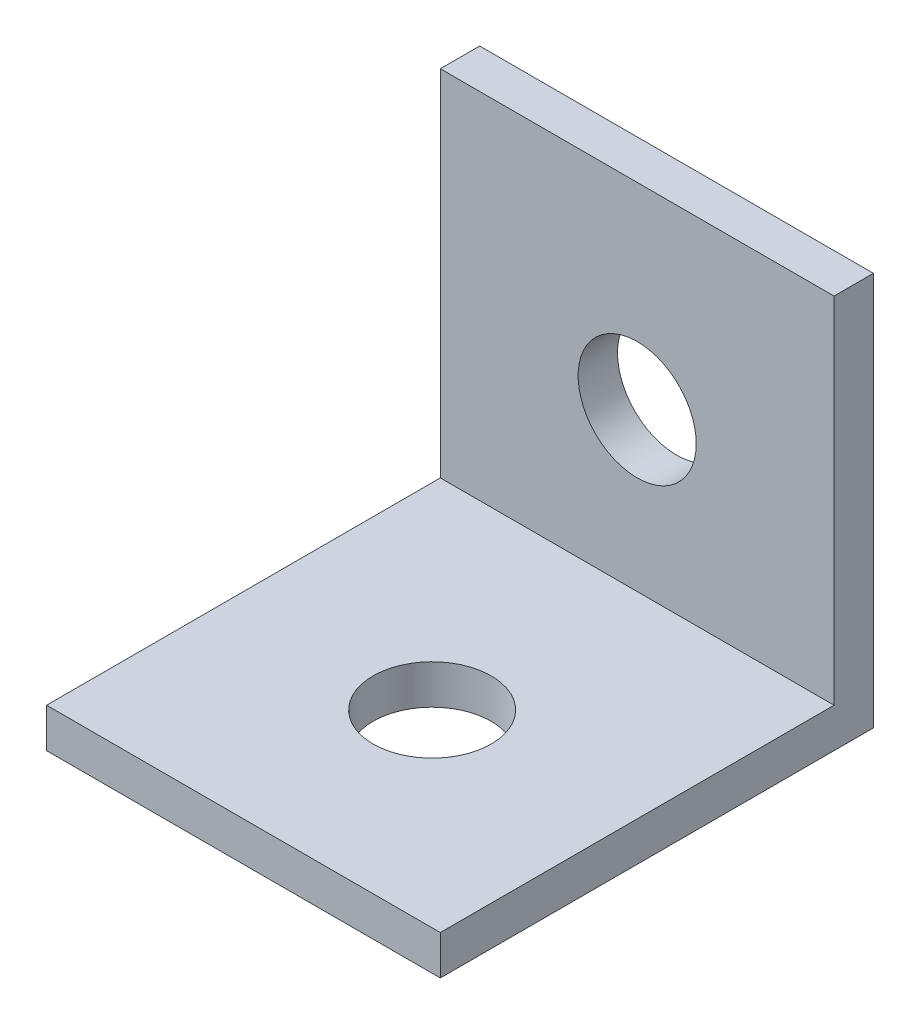
ISO-10303-21;
HEADER;
FILE_DESCRIPTION(('STEP AP214'),'2;1');
FILE_NAME('part.step','',(''),(''),'','','');
FILE_SCHEMA(('AUTOMOTIVE_DESIGN { 1 0 10303 214 1 1 1 1 }'));
ENDSEC;
DATA;
#1=APPLICATION_CONTEXT('core data for automotive mechanical design processes');
#2=APPLICATION_PROTOCOL_DEFINITION('international standard','automotive_design',2000,#1);
#3=PRODUCT_CONTEXT('',#1,'mechanical');
#4=PRODUCT('Part','Part','',(#3));
#5=PRODUCT_RELATED_PRODUCT_CATEGORY('part','',(#4));
#6=PRODUCT_DEFINITION_FORMATION('','',#4);
#7=PRODUCT_DEFINITION_CONTEXT('part definition',#1,'design');
#8=PRODUCT_DEFINITION('design','',#6,#7);
#9=PRODUCT_DEFINITION_SHAPE('','',#8);
#10=(LENGTH_UNIT() NAMED_UNIT(*) SI_UNIT(.MILLI.,.METRE.));
#11=(NAMED_UNIT(*) PLANE_ANGLE_UNIT() SI_UNIT($,.RADIAN.));
#12=(NAMED_UNIT(*) SI_UNIT($,.STERADIAN.) SOLID_ANGLE_UNIT());
#13=UNCERTAINTY_MEASURE_WITH_UNIT(LENGTH_MEASURE(1.E-05),#10,'distance_accuracy_value','');
#14=(GEOMETRIC_REPRESENTATION_CONTEXT(3) GLOBAL_UNCERTAINTY_ASSIGNED_CONTEXT((#13)) GLOBAL_UNIT_ASSIGNED_CONTEXT((#10,
#11,#12)) REPRESENTATION_CONTEXT('',''));
#15=CARTESIAN_POINT('',(0.,0.,0.));
#16=DIRECTION('',(0.,0.,1.));
#17=DIRECTION('',(1.,0.,0.));
#18=AXIS2_PLACEMENT_3D('',#15,#16,#17);
#19=CARTESIAN_POINT('',(0.,20.,2.));
#20=DIRECTION('',(0.,-1.,0.));
#21=DIRECTION('',(0.,0.,-1.));
#22=AXIS2_PLACEMENT_3D('',#19,#20,#21);
#23=PLANE('',#22);
#24=DIRECTION('',(-1.,0.,0.));
#25=VECTOR('',#24,1.);
#26=CARTESIAN_POINT('',(0.,20.,0.));
#27=LINE('',#26,#25);
#28=CARTESIAN_POINT('',(20.,20.,0.));
#29=VERTEX_POINT('',#28);
#30=CARTESIAN_POINT('',(0.,20.,0.));
#31=VERTEX_POINT('',#30);
#32=EDGE_CURVE('E100',#29,#31,#27,.T.);
#33=ORIENTED_EDGE('',*,*,#32,.T.);
#34=DIRECTION('',(0.,0.,-1.));
#35=VECTOR('',#34,1.);
#36=CARTESIAN_POINT('',(0.,20.,2.));
#37=LINE('',#36,#35);
#38=CARTESIAN_POINT('',(0.,20.,2.));
#39=VERTEX_POINT('',#38);
#40=EDGE_CURVE('E11',#39,#31,#37,.T.);
#41=ORIENTED_EDGE('',*,*,#40,.F.);
#42=DIRECTION('',(-1.,0.,0.));
#43=VECTOR('',#42,1.);
#44=CARTESIAN_POINT('',(0.,20.,2.));
#45=LINE('',#44,#43);
#46=CARTESIAN_POINT('',(20.,20.,2.));
#47=VERTEX_POINT('',#46);
#48=EDGE_CURVE('E94',#47,#39,#45,.T.);
#49=ORIENTED_EDGE('',*,*,#48,.F.);
#50=DIRECTION('',(0.,0.,-1.));
#51=VECTOR('',#50,1.);
#52=CARTESIAN_POINT('',(20.,20.,2.));
#53=LINE('',#52,#51);
#54=EDGE_CURVE('E85',#47,#29,#53,.T.);
#55=ORIENTED_EDGE('',*,*,#54,.T.);
#56=EDGE_LOOP('',(#33,#41,#49,#55));
#57=FACE_BOUND('',#56,.T.);
#58=ADVANCED_FACE('F40',(#57),#23,.F.);
#59=CARTESIAN_POINT('',(0.,0.,2.));
#60=DIRECTION('',(1.,0.,0.));
#61=DIRECTION('',(0.,0.,-1.));
#62=AXIS2_PLACEMENT_3D('',#59,#60,#61);
#63=PLANE('',#62);
#64=DIRECTION('',(0.,-1.,0.));
#65=VECTOR('',#64,1.);
#66=CARTESIAN_POINT('',(0.,0.,0.));
#67=LINE('',#66,#65);
#68=CARTESIAN_POINT('',(0.,0.,0.));
#69=VERTEX_POINT('',#68);
#70=EDGE_CURVE('E104',#31,#69,#67,.T.);
#71=ORIENTED_EDGE('',*,*,#70,.T.);
#72=DIRECTION('',(0.,0.,-1.));
#73=VECTOR('',#72,1.);
#74=CARTESIAN_POINT('',(0.,0.,2.));
#75=LINE('',#74,#73);
#76=CARTESIAN_POINT('',(0.,0.,22.));
#77=VERTEX_POINT('',#76);
#78=EDGE_CURVE('E49',#77,#69,#75,.T.);
#79=ORIENTED_EDGE('',*,*,#78,.F.);
#80=DIRECTION('',(0.,-1.,0.));
#81=VECTOR('',#80,1.);
#82=CARTESIAN_POINT('',(0.,0.,22.));
#83=LINE('',#82,#81);
#84=CARTESIAN_POINT('',(0.,2.,22.));
#85=VERTEX_POINT('',#84);
#86=EDGE_CURVE('E135',#85,#77,#83,.T.);
#87=ORIENTED_EDGE('',*,*,#86,.F.);
#88=DIRECTION('',(0.,0.,-1.));
#89=VECTOR('',#88,1.);
#90=CARTESIAN_POINT('',(0.,2.,22.));
#91=LINE('',#90,#89);
#92=CARTESIAN_POINT('',(0.,2.,2.));
#93=VERTEX_POINT('',#92);
#94=EDGE_CURVE('E112',#85,#93,#91,.T.);
#95=ORIENTED_EDGE('',*,*,#94,.T.);
#96=DIRECTION('',(0.,-1.,0.));
#97=VECTOR('',#96,1.);
#98=CARTESIAN_POINT('',(0.,0.,2.));
#99=LINE('',#98,#97);
#100=EDGE_CURVE('E125',#39,#93,#99,.T.);
#101=ORIENTED_EDGE('',*,*,#100,.F.);
#102=ORIENTED_EDGE('',*,*,#40,.T.);
#103=EDGE_LOOP('',(#71,#79,#87,#95,#101,#102));
#104=FACE_BOUND('',#103,.T.);
#105=ADVANCED_FACE('F195',(#104),#63,.F.);
#106=CARTESIAN_POINT('',(0.,0.,2.));
#107=DIRECTION('',(0.,1.,0.));
#108=DIRECTION('',(0.,0.,1.));
#109=AXIS2_PLACEMENT_3D('',#106,#107,#108);
#110=PLANE('',#109);
#111=CARTESIAN_POINT('',(10.,0.,12.4150901312258));
#112=DIRECTION('',(0.,1.,0.));
#113=DIRECTION('',(0.,0.,1.));
#114=AXIS2_PLACEMENT_3D('',#111,#112,#113);
#115=CIRCLE('',#114,3.);
#116=CARTESIAN_POINT('',(10.,0.,15.4150901312258));
#117=VERTEX_POINT('',#116);
#118=EDGE_CURVE('E140',#117,#117,#115,.T.);
#119=ORIENTED_EDGE('',*,*,#118,.T.);
#120=EDGE_LOOP('',(#119));
#121=FACE_BOUND('',#120,.T.);
#122=DIRECTION('',(1.,0.,0.));
#123=VECTOR('',#122,1.);
#124=CARTESIAN_POINT('',(0.,0.,0.));
#125=LINE('',#124,#123);
#126=CARTESIAN_POINT('',(20.,0.,0.));
#127=VERTEX_POINT('',#126);
#128=EDGE_CURVE('E95',#69,#127,#125,.T.);
#129=ORIENTED_EDGE('',*,*,#128,.T.);
#130=DIRECTION('',(0.,0.,-1.));
#131=VECTOR('',#130,1.);
#132=CARTESIAN_POINT('',(20.,0.,2.));
#133=LINE('',#132,#131);
#134=CARTESIAN_POINT('',(20.,0.,22.));
#135=VERTEX_POINT('',#134);
#136=EDGE_CURVE('E89',#135,#127,#133,.T.);
#137=ORIENTED_EDGE('',*,*,#136,.F.);
#138=DIRECTION('',(1.,0.,0.));
#139=VECTOR('',#138,1.);
#140=CARTESIAN_POINT('',(20.,0.,22.));
#141=LINE('',#140,#139);
#142=EDGE_CURVE('E139',#77,#135,#141,.T.);
#143=ORIENTED_EDGE('',*,*,#142,.F.);
#144=ORIENTED_EDGE('',*,*,#78,.T.);
#145=EDGE_LOOP('',(#129,#137,#143,#144));
#146=FACE_BOUND('',#145,.T.);
#147=ADVANCED_FACE('F199',(#121,#146),#110,.F.);
#148=CARTESIAN_POINT('',(20.,0.,2.));
#149=DIRECTION('',(-1.,0.,0.));
#150=DIRECTION('',(0.,0.,1.));
#151=AXIS2_PLACEMENT_3D('',#148,#149,#150);
#152=PLANE('',#151);
#153=DIRECTION('',(0.,1.,0.));
#154=VECTOR('',#153,1.);
#155=CARTESIAN_POINT('',(20.,0.,0.));
#156=LINE('',#155,#154);
#157=EDGE_CURVE('E82',#127,#29,#156,.T.);
#158=ORIENTED_EDGE('',*,*,#157,.T.);
#159=ORIENTED_EDGE('',*,*,#54,.F.);
#160=DIRECTION('',(0.,1.,0.));
#161=VECTOR('',#160,1.);
#162=CARTESIAN_POINT('',(20.,0.,2.));
#163=LINE('',#162,#161);
#164=CARTESIAN_POINT('',(20.,2.,2.));
#165=VERTEX_POINT('',#164);
#166=EDGE_CURVE('E62',#165,#47,#163,.T.);
#167=ORIENTED_EDGE('',*,*,#166,.F.);
#168=DIRECTION('',(0.,0.,-1.));
#169=VECTOR('',#168,1.);
#170=CARTESIAN_POINT('',(20.,2.,22.));
#171=LINE('',#170,#169);
#172=CARTESIAN_POINT('',(20.,2.,22.));
#173=VERTEX_POINT('',#172);
#174=EDGE_CURVE('E106',#173,#165,#171,.T.);
#175=ORIENTED_EDGE('',*,*,#174,.F.);
#176=DIRECTION('',(0.,1.,0.));
#177=VECTOR('',#176,1.);
#178=CARTESIAN_POINT('',(20.,2.,22.));
#179=LINE('',#178,#177);
#180=EDGE_CURVE('E158',#135,#173,#179,.T.);
#181=ORIENTED_EDGE('',*,*,#180,.F.);
#182=ORIENTED_EDGE('',*,*,#136,.T.);
#183=EDGE_LOOP('',(#158,#159,#167,#175,#181,#182));
#184=FACE_BOUND('',#183,.T.);
#185=ADVANCED_FACE('F84',(#184),#152,.F.);
#186=CARTESIAN_POINT('',(0.,0.,2.));
#187=DIRECTION('',(0.,0.,1.));
#188=DIRECTION('',(1.,0.,0.));
#189=AXIS2_PLACEMENT_3D('',#186,#187,#188);
#190=PLANE('',#189);
#191=CARTESIAN_POINT('',(10.,10.,2.));
#192=DIRECTION('',(0.,0.,1.));
#193=DIRECTION('',(1.,0.,0.));
#194=AXIS2_PLACEMENT_3D('',#191,#192,#193);
#195=CIRCLE('',#194,3.);
#196=CARTESIAN_POINT('',(13.,10.,2.));
#197=VERTEX_POINT('',#196);
#198=EDGE_CURVE('E174',#197,#197,#195,.T.);
#199=ORIENTED_EDGE('',*,*,#198,.F.);
#200=EDGE_LOOP('',(#199));
#201=FACE_BOUND('',#200,.T.);
#202=DIRECTION('',(-1.,0.,0.));
#203=VECTOR('',#202,1.);
#204=CARTESIAN_POINT('',(0.,2.,2.));
#205=LINE('',#204,#203);
#206=EDGE_CURVE('E57',#165,#93,#205,.T.);
#207=ORIENTED_EDGE('',*,*,#206,.F.);
#208=ORIENTED_EDGE('',*,*,#166,.T.);
#209=ORIENTED_EDGE('',*,*,#48,.T.);
#210=ORIENTED_EDGE('',*,*,#100,.T.);
#211=EDGE_LOOP('',(#207,#208,#209,#210));
#212=FACE_BOUND('',#211,.T.);
#213=ADVANCED_FACE('F208',(#201,#212),#190,.T.);
#214=CARTESIAN_POINT('',(0.,0.,0.));
#215=DIRECTION('',(0.,0.,1.));
#216=DIRECTION('',(1.,0.,0.));
#217=AXIS2_PLACEMENT_3D('',#214,#215,#216);
#218=PLANE('',#217);
#219=CARTESIAN_POINT('',(10.,10.,0.));
#220=DIRECTION('',(0.,0.,1.));
#221=DIRECTION('',(1.,0.,0.));
#222=AXIS2_PLACEMENT_3D('',#219,#220,#221);
#223=CIRCLE('',#222,3.);
#224=CARTESIAN_POINT('',(13.,10.,0.));
#225=VERTEX_POINT('',#224);
#226=EDGE_CURVE('E43',#225,#225,#223,.T.);
#227=ORIENTED_EDGE('',*,*,#226,.T.);
#228=EDGE_LOOP('',(#227));
#229=FACE_BOUND('',#228,.T.);
#230=ORIENTED_EDGE('',*,*,#32,.F.);
#231=ORIENTED_EDGE('',*,*,#157,.F.);
#232=ORIENTED_EDGE('',*,*,#128,.F.);
#233=ORIENTED_EDGE('',*,*,#70,.F.);
#234=EDGE_LOOP('',(#230,#231,#232,#233));
#235=FACE_BOUND('',#234,.T.);
#236=ADVANCED_FACE('F103',(#229,#235),#218,.F.);
#237=CARTESIAN_POINT('',(0.,2.,22.));
#238=DIRECTION('',(0.,-1.,0.));
#239=DIRECTION('',(0.,0.,-1.));
#240=AXIS2_PLACEMENT_3D('',#237,#238,#239);
#241=PLANE('',#240);
#242=CARTESIAN_POINT('',(10.,2.,12.4150901312258));
#243=DIRECTION('',(0.,1.,0.));
#244=DIRECTION('',(0.,0.,1.));
#245=AXIS2_PLACEMENT_3D('',#242,#243,#244);
#246=CIRCLE('',#245,3.);
#247=CARTESIAN_POINT('',(10.,2.,15.4150901312258));
#248=VERTEX_POINT('',#247);
#249=EDGE_CURVE('E170',#248,#248,#246,.T.);
#250=ORIENTED_EDGE('',*,*,#249,.F.);
#251=EDGE_LOOP('',(#250));
#252=FACE_BOUND('',#251,.T.);
#253=ORIENTED_EDGE('',*,*,#206,.T.);
#254=ORIENTED_EDGE('',*,*,#94,.F.);
#255=DIRECTION('',(-1.,0.,0.));
#256=VECTOR('',#255,1.);
#257=CARTESIAN_POINT('',(0.,2.,22.));
#258=LINE('',#257,#256);
#259=EDGE_CURVE('E152',#173,#85,#258,.T.);
#260=ORIENTED_EDGE('',*,*,#259,.F.);
#261=ORIENTED_EDGE('',*,*,#174,.T.);
#262=EDGE_LOOP('',(#253,#254,#260,#261));
#263=FACE_BOUND('',#262,.T.);
#264=ADVANCED_FACE('F211',(#252,#263),#241,.F.);
#265=CARTESIAN_POINT('',(0.,0.,22.));
#266=DIRECTION('',(0.,0.,-1.));
#267=DIRECTION('',(-1.,0.,0.));
#268=AXIS2_PLACEMENT_3D('',#265,#266,#267);
#269=PLANE('',#268);
#270=ORIENTED_EDGE('',*,*,#142,.T.);
#271=ORIENTED_EDGE('',*,*,#180,.T.);
#272=ORIENTED_EDGE('',*,*,#259,.T.);
#273=ORIENTED_EDGE('',*,*,#86,.T.);
#274=EDGE_LOOP('',(#270,#271,#272,#273));
#275=FACE_BOUND('',#274,.T.);
#276=ADVANCED_FACE('F191',(#275),#269,.F.);
#277=CARTESIAN_POINT('',(10.,-8.,12.4150901312258));
#278=DIRECTION('',(0.,1.,0.));
#279=DIRECTION('',(0.,0.,1.));
#280=AXIS2_PLACEMENT_3D('',#277,#278,#279);
#281=CYLINDRICAL_SURFACE('',#280,3.);
#282=ORIENTED_EDGE('',*,*,#249,.T.);
#283=EDGE_LOOP('',(#282));
#284=FACE_BOUND('',#283,.T.);
#285=ORIENTED_EDGE('',*,*,#118,.F.);
#286=EDGE_LOOP('',(#285));
#287=FACE_BOUND('',#286,.T.);
#288=ADVANCED_FACE('F186',(#284,#287),#281,.F.);
#289=CARTESIAN_POINT('',(10.,10.,-8.));
#290=DIRECTION('',(0.,0.,1.));
#291=DIRECTION('',(1.,0.,0.));
#292=AXIS2_PLACEMENT_3D('',#289,#290,#291);
#293=CYLINDRICAL_SURFACE('',#292,3.);
#294=ORIENTED_EDGE('',*,*,#198,.T.);
#295=EDGE_LOOP('',(#294));
#296=FACE_BOUND('',#295,.T.);
#297=ORIENTED_EDGE('',*,*,#226,.F.);
#298=EDGE_LOOP('',(#297));
#299=FACE_BOUND('',#298,.T.);
#300=ADVANCED_FACE('F184',(#296,#299),#293,.F.);
#301=CLOSED_SHELL('',(#58,#105,#147,#185,#213,#236,#264,#276,#288,#300));
#302=MANIFOLD_SOLID_BREP('B2',#301);
#303=ADVANCED_BREP_SHAPE_REPRESENTATION('',(#18,#302),#14);
#304=SHAPE_DEFINITION_REPRESENTATION(#9,#303);
ENDSEC;
END-ISO-10303-21;
